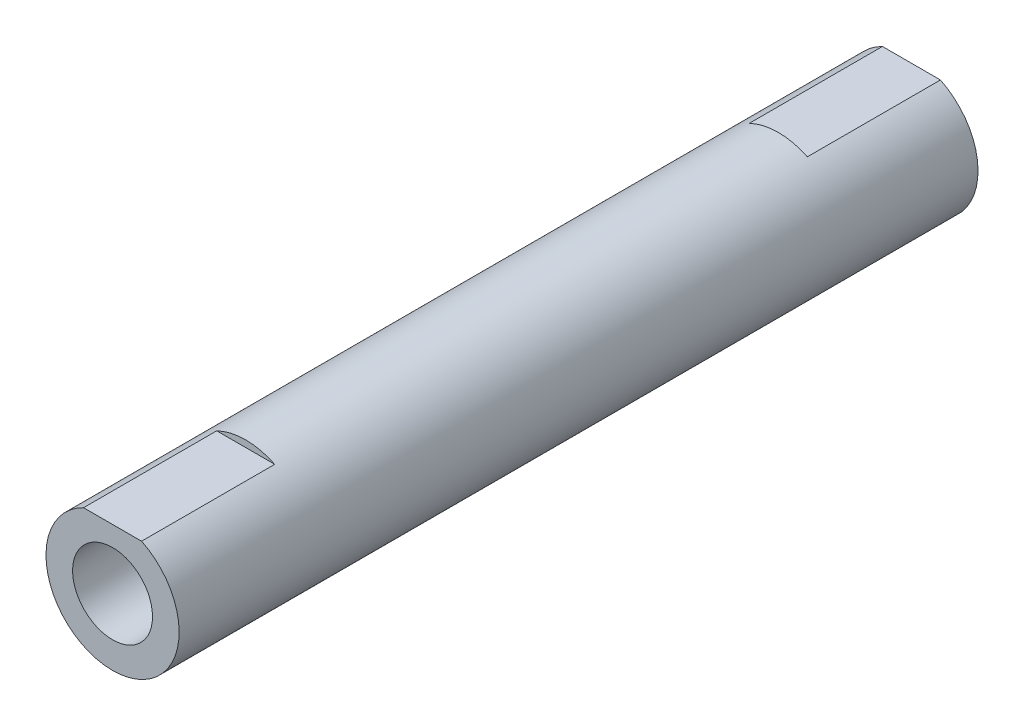
ISO-10303-21;
HEADER;
FILE_DESCRIPTION(('STEP AP214'),'2;1');
FILE_NAME('part.step','',(''),(''),'','','');
FILE_SCHEMA(('AUTOMOTIVE_DESIGN { 1 0 10303 214 1 1 1 1 }'));
ENDSEC;
DATA;
#1=APPLICATION_CONTEXT('core data for automotive mechanical design processes');
#2=APPLICATION_PROTOCOL_DEFINITION('international standard','automotive_design',2000,#1);
#3=PRODUCT_CONTEXT('',#1,'mechanical');
#4=PRODUCT('Part','Part','',(#3));
#5=PRODUCT_RELATED_PRODUCT_CATEGORY('part','',(#4));
#6=PRODUCT_DEFINITION_FORMATION('','',#4);
#7=PRODUCT_DEFINITION_CONTEXT('part definition',#1,'design');
#8=PRODUCT_DEFINITION('design','',#6,#7);
#9=PRODUCT_DEFINITION_SHAPE('','',#8);
#10=(LENGTH_UNIT() NAMED_UNIT(*) SI_UNIT(.MILLI.,.METRE.));
#11=(NAMED_UNIT(*) PLANE_ANGLE_UNIT() SI_UNIT($,.RADIAN.));
#12=(NAMED_UNIT(*) SI_UNIT($,.STERADIAN.) SOLID_ANGLE_UNIT());
#13=UNCERTAINTY_MEASURE_WITH_UNIT(LENGTH_MEASURE(1.E-05),#10,'distance_accuracy_value','');
#14=(GEOMETRIC_REPRESENTATION_CONTEXT(3) GLOBAL_UNCERTAINTY_ASSIGNED_CONTEXT((#13)) GLOBAL_UNIT_ASSIGNED_CONTEXT((#10,
#11,#12)) REPRESENTATION_CONTEXT('',''));
#15=CARTESIAN_POINT('',(0.,0.,0.));
#16=DIRECTION('',(0.,0.,1.));
#17=DIRECTION('',(1.,0.,0.));
#18=AXIS2_PLACEMENT_3D('',#15,#16,#17);
#19=CARTESIAN_POINT('',(0.,0.,30.));
#20=DIRECTION('',(0.,0.,1.));
#21=DIRECTION('',(1.,0.,0.));
#22=AXIS2_PLACEMENT_3D('',#19,#20,#21);
#23=PLANE('',#22);
#24=CARTESIAN_POINT('',(0.,0.,30.));
#25=DIRECTION('',(0.,0.,1.));
#26=DIRECTION('',(1.,0.,0.));
#27=AXIS2_PLACEMENT_3D('',#24,#25,#26);
#28=CIRCLE('',#27,3.);
#29=CARTESIAN_POINT('',(3.,0.,30.));
#30=VERTEX_POINT('',#29);
#31=EDGE_CURVE('E100',#30,#30,#28,.T.);
#32=ORIENTED_EDGE('',*,*,#31,.F.);
#33=EDGE_LOOP('',(#32));
#34=FACE_BOUND('',#33,.T.);
#35=CARTESIAN_POINT('',(0.,0.,30.));
#36=DIRECTION('',(0.,0.,1.));
#37=DIRECTION('',(1.,0.,0.));
#38=AXIS2_PLACEMENT_3D('',#35,#36,#37);
#39=CIRCLE('',#38,5.);
#40=CARTESIAN_POINT('',(-2.17944947177034,4.5,30.));
#41=VERTEX_POINT('',#40);
#42=CARTESIAN_POINT('',(2.17944947177034,4.5,30.));
#43=VERTEX_POINT('',#42);
#44=EDGE_CURVE('E11',#41,#43,#39,.T.);
#45=ORIENTED_EDGE('',*,*,#44,.T.);
#46=DIRECTION('',(-1.,0.,0.));
#47=VECTOR('',#46,1.);
#48=CARTESIAN_POINT('',(2.17944947177034,4.5,30.));
#49=LINE('',#48,#47);
#50=EDGE_CURVE('E82',#43,#41,#49,.T.);
#51=ORIENTED_EDGE('',*,*,#50,.T.);
#52=EDGE_LOOP('',(#45,#51));
#53=FACE_BOUND('',#52,.T.);
#54=ADVANCED_FACE('F32',(#34,#53),#23,.T.);
#55=CARTESIAN_POINT('',(0.,0.,30.));
#56=DIRECTION('',(0.,0.,-1.));
#57=DIRECTION('',(-1.,0.,0.));
#58=AXIS2_PLACEMENT_3D('',#55,#56,#57);
#59=CYLINDRICAL_SURFACE('',#58,5.);
#60=CARTESIAN_POINT('',(0.,0.,-20.));
#61=DIRECTION('',(0.,0.,-1.));
#62=DIRECTION('',(-1.,0.,0.));
#63=AXIS2_PLACEMENT_3D('',#60,#61,#62);
#64=CIRCLE('',#63,5.);
#65=CARTESIAN_POINT('',(-2.17944947177034,4.5,-20.));
#66=VERTEX_POINT('',#65);
#67=CARTESIAN_POINT('',(2.17944947177034,4.5,-20.));
#68=VERTEX_POINT('',#67);
#69=EDGE_CURVE('E90',#66,#68,#64,.T.);
#70=ORIENTED_EDGE('',*,*,#69,.F.);
#71=DIRECTION('',(0.,0.,-1.));
#72=VECTOR('',#71,1.);
#73=CARTESIAN_POINT('',(-2.17944947177034,4.5,-20.));
#74=LINE('',#73,#72);
#75=CARTESIAN_POINT('',(-2.17944947177034,4.5,-30.));
#76=VERTEX_POINT('',#75);
#77=EDGE_CURVE('E95',#66,#76,#74,.T.);
#78=ORIENTED_EDGE('',*,*,#77,.T.);
#79=CARTESIAN_POINT('',(0.,0.,-30.));
#80=DIRECTION('',(0.,0.,1.));
#81=DIRECTION('',(1.,0.,0.));
#82=AXIS2_PLACEMENT_3D('',#79,#80,#81);
#83=CIRCLE('',#82,5.);
#84=CARTESIAN_POINT('',(2.17944947177034,4.5,-30.));
#85=VERTEX_POINT('',#84);
#86=EDGE_CURVE('E36',#76,#85,#83,.T.);
#87=ORIENTED_EDGE('',*,*,#86,.T.);
#88=DIRECTION('',(0.,0.,-1.));
#89=VECTOR('',#88,1.);
#90=CARTESIAN_POINT('',(2.17944947177034,4.5,-20.));
#91=LINE('',#90,#89);
#92=EDGE_CURVE('E93',#68,#85,#91,.T.);
#93=ORIENTED_EDGE('',*,*,#92,.F.);
#94=EDGE_LOOP('',(#70,#78,#87,#93));
#95=FACE_BOUND('',#94,.T.);
#96=DIRECTION('',(0.,0.,1.));
#97=VECTOR('',#96,1.);
#98=CARTESIAN_POINT('',(2.17944947177034,4.5,20.));
#99=LINE('',#98,#97);
#100=CARTESIAN_POINT('',(2.17944947177034,4.5,20.));
#101=VERTEX_POINT('',#100);
#102=EDGE_CURVE('E47',#101,#43,#99,.T.);
#103=ORIENTED_EDGE('',*,*,#102,.T.);
#104=ORIENTED_EDGE('',*,*,#44,.F.);
#105=DIRECTION('',(0.,0.,1.));
#106=VECTOR('',#105,1.);
#107=CARTESIAN_POINT('',(-2.17944947177034,4.5,20.));
#108=LINE('',#107,#106);
#109=CARTESIAN_POINT('',(-2.17944947177034,4.5,20.));
#110=VERTEX_POINT('',#109);
#111=EDGE_CURVE('E74',#110,#41,#108,.T.);
#112=ORIENTED_EDGE('',*,*,#111,.F.);
#113=CARTESIAN_POINT('',(0.,0.,20.));
#114=DIRECTION('',(0.,0.,-1.));
#115=DIRECTION('',(-1.,0.,0.));
#116=AXIS2_PLACEMENT_3D('',#113,#114,#115);
#117=CIRCLE('',#116,5.);
#118=EDGE_CURVE('E78',#110,#101,#117,.T.);
#119=ORIENTED_EDGE('',*,*,#118,.T.);
#120=EDGE_LOOP('',(#103,#104,#112,#119));
#121=FACE_BOUND('',#120,.T.);
#122=ADVANCED_FACE('F34',(#95,#121),#59,.T.);
#123=CARTESIAN_POINT('',(0.,0.,-30.));
#124=DIRECTION('',(0.,0.,1.));
#125=DIRECTION('',(1.,0.,0.));
#126=AXIS2_PLACEMENT_3D('',#123,#124,#125);
#127=PLANE('',#126);
#128=ORIENTED_EDGE('',*,*,#86,.F.);
#129=DIRECTION('',(-1.,0.,0.));
#130=VECTOR('',#129,1.);
#131=CARTESIAN_POINT('',(2.17944947177034,4.5,-30.));
#132=LINE('',#131,#130);
#133=EDGE_CURVE('E86',#85,#76,#132,.T.);
#134=ORIENTED_EDGE('',*,*,#133,.F.);
#135=EDGE_LOOP('',(#128,#134));
#136=FACE_BOUND('',#135,.T.);
#137=CARTESIAN_POINT('',(0.,0.,-30.));
#138=DIRECTION('',(0.,0.,1.));
#139=DIRECTION('',(1.,0.,0.));
#140=AXIS2_PLACEMENT_3D('',#137,#138,#139);
#141=CIRCLE('',#140,3.);
#142=CARTESIAN_POINT('',(3.,0.,-30.));
#143=VERTEX_POINT('',#142);
#144=EDGE_CURVE('E98',#143,#143,#141,.T.);
#145=ORIENTED_EDGE('',*,*,#144,.T.);
#146=EDGE_LOOP('',(#145));
#147=FACE_BOUND('',#146,.T.);
#148=ADVANCED_FACE('F106',(#136,#147),#127,.F.);
#149=CARTESIAN_POINT('',(0.,0.,30.));
#150=DIRECTION('',(0.,0.,-1.));
#151=DIRECTION('',(-1.,0.,0.));
#152=AXIS2_PLACEMENT_3D('',#149,#150,#151);
#153=CYLINDRICAL_SURFACE('',#152,3.);
#154=ORIENTED_EDGE('',*,*,#31,.T.);
#155=EDGE_LOOP('',(#154));
#156=FACE_BOUND('',#155,.T.);
#157=ORIENTED_EDGE('',*,*,#144,.F.);
#158=EDGE_LOOP('',(#157));
#159=FACE_BOUND('',#158,.T.);
#160=ADVANCED_FACE('F108',(#156,#159),#153,.F.);
#161=CARTESIAN_POINT('',(2.17944947177034,4.5,-20.));
#162=DIRECTION('',(0.,-1.,0.));
#163=DIRECTION('',(0.,0.,-1.));
#164=AXIS2_PLACEMENT_3D('',#161,#162,#163);
#165=PLANE('',#164);
#166=ORIENTED_EDGE('',*,*,#133,.T.);
#167=ORIENTED_EDGE('',*,*,#77,.F.);
#168=DIRECTION('',(-1.,0.,0.));
#169=VECTOR('',#168,1.);
#170=CARTESIAN_POINT('',(2.17944947177034,4.5,-20.));
#171=LINE('',#170,#169);
#172=EDGE_CURVE('E54',#68,#66,#171,.T.);
#173=ORIENTED_EDGE('',*,*,#172,.F.);
#174=ORIENTED_EDGE('',*,*,#92,.T.);
#175=EDGE_LOOP('',(#166,#167,#173,#174));
#176=FACE_BOUND('',#175,.T.);
#177=ADVANCED_FACE('F110',(#176),#165,.F.);
#178=CARTESIAN_POINT('',(0.,0.,-20.));
#179=DIRECTION('',(0.,0.,-1.));
#180=DIRECTION('',(-1.,0.,0.));
#181=AXIS2_PLACEMENT_3D('',#178,#179,#180);
#182=PLANE('',#181);
#183=ORIENTED_EDGE('',*,*,#69,.T.);
#184=ORIENTED_EDGE('',*,*,#172,.T.);
#185=EDGE_LOOP('',(#183,#184));
#186=FACE_BOUND('',#185,.T.);
#187=ADVANCED_FACE('F117',(#186),#182,.T.);
#188=CARTESIAN_POINT('',(2.17944947177034,4.5,20.));
#189=DIRECTION('',(0.,1.,0.));
#190=DIRECTION('',(0.,0.,1.));
#191=AXIS2_PLACEMENT_3D('',#188,#189,#190);
#192=PLANE('',#191);
#193=ORIENTED_EDGE('',*,*,#50,.F.);
#194=ORIENTED_EDGE('',*,*,#102,.F.);
#195=DIRECTION('',(-1.,0.,0.));
#196=VECTOR('',#195,1.);
#197=CARTESIAN_POINT('',(2.17944947177034,4.5,20.));
#198=LINE('',#197,#196);
#199=EDGE_CURVE('E70',#101,#110,#198,.T.);
#200=ORIENTED_EDGE('',*,*,#199,.T.);
#201=ORIENTED_EDGE('',*,*,#111,.T.);
#202=EDGE_LOOP('',(#193,#194,#200,#201));
#203=FACE_BOUND('',#202,.T.);
#204=ADVANCED_FACE('F72',(#203),#192,.T.);
#205=CARTESIAN_POINT('',(0.,0.,20.));
#206=DIRECTION('',(0.,0.,1.));
#207=DIRECTION('',(-1.,0.,0.));
#208=AXIS2_PLACEMENT_3D('',#205,#206,#207);
#209=PLANE('',#208);
#210=ORIENTED_EDGE('',*,*,#118,.F.);
#211=ORIENTED_EDGE('',*,*,#199,.F.);
#212=EDGE_LOOP('',(#210,#211));
#213=FACE_BOUND('',#212,.T.);
#214=ADVANCED_FACE('F80',(#213),#209,.T.);
#215=CLOSED_SHELL('',(#54,#122,#148,#160,#177,#187,#204,#214));
#216=MANIFOLD_SOLID_BREP('B2',#215);
#217=ADVANCED_BREP_SHAPE_REPRESENTATION('',(#18,#216),#14);
#218=SHAPE_DEFINITION_REPRESENTATION(#9,#217);
ENDSEC;
END-ISO-10303-21;
